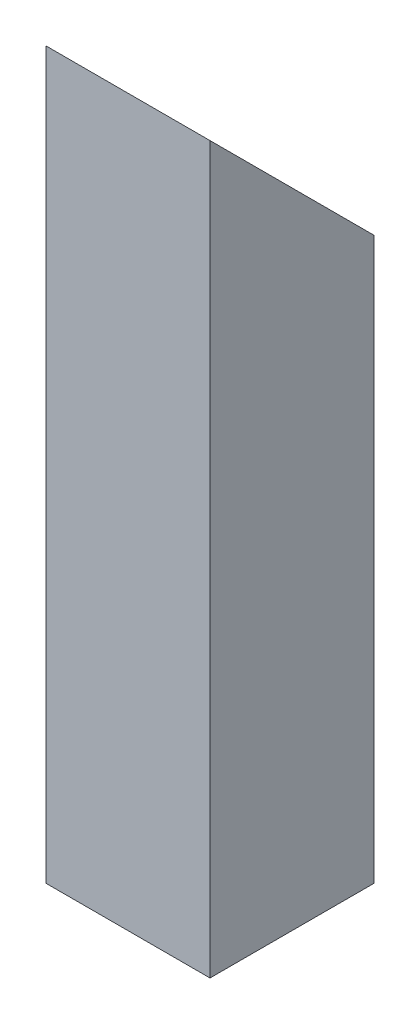
ISO-10303-21;
HEADER;
FILE_DESCRIPTION(('STEP AP214'),'2;1');
FILE_NAME('part.step','',(''),(''),'','','');
FILE_SCHEMA(('AUTOMOTIVE_DESIGN { 1 0 10303 214 1 1 1 1 }'));
ENDSEC;
DATA;
#1=APPLICATION_CONTEXT('core data for automotive mechanical design processes');
#2=APPLICATION_PROTOCOL_DEFINITION('international standard','automotive_design',2000,#1);
#3=PRODUCT_CONTEXT('',#1,'mechanical');
#4=PRODUCT('Part','Part','',(#3));
#5=PRODUCT_RELATED_PRODUCT_CATEGORY('part','',(#4));
#6=PRODUCT_DEFINITION_FORMATION('','',#4);
#7=PRODUCT_DEFINITION_CONTEXT('part definition',#1,'design');
#8=PRODUCT_DEFINITION('design','',#6,#7);
#9=PRODUCT_DEFINITION_SHAPE('','',#8);
#10=(LENGTH_UNIT() NAMED_UNIT(*) SI_UNIT(.MILLI.,.METRE.));
#11=(NAMED_UNIT(*) PLANE_ANGLE_UNIT() SI_UNIT($,.RADIAN.));
#12=(NAMED_UNIT(*) SI_UNIT($,.STERADIAN.) SOLID_ANGLE_UNIT());
#13=UNCERTAINTY_MEASURE_WITH_UNIT(LENGTH_MEASURE(1.E-05),#10,'distance_accuracy_value','');
#14=(GEOMETRIC_REPRESENTATION_CONTEXT(3) GLOBAL_UNCERTAINTY_ASSIGNED_CONTEXT((#13)) GLOBAL_UNIT_ASSIGNED_CONTEXT((#10,
#11,#12)) REPRESENTATION_CONTEXT('',''));
#15=CARTESIAN_POINT('',(0.,0.,0.));
#16=DIRECTION('',(0.,0.,1.));
#17=DIRECTION('',(1.,0.,0.));
#18=AXIS2_PLACEMENT_3D('',#15,#16,#17);
#19=CARTESIAN_POINT('',(44.45,0.,-44.45));
#20=DIRECTION('',(0.,0.,-1.));
#21=DIRECTION('',(-1.,0.,0.));
#22=AXIS2_PLACEMENT_3D('',#19,#20,#21);
#23=PLANE('',#22);
#24=DIRECTION('',(0.,1.,0.));
#25=VECTOR('',#24,1.);
#26=CARTESIAN_POINT('',(0.,0.,-44.45));
#27=LINE('',#26,#25);
#28=CARTESIAN_POINT('',(0.,152.4,-44.45));
#29=VERTEX_POINT('',#28);
#30=CARTESIAN_POINT('',(0.,0.,-44.45));
#31=VERTEX_POINT('',#30);
#32=EDGE_CURVE('E88',#29,#31,#27,.F.);
#33=ORIENTED_EDGE('',*,*,#32,.F.);
#34=DIRECTION('',(1.,0.,0.));
#35=VECTOR('',#34,1.);
#36=CARTESIAN_POINT('',(22.225,152.4,-44.45));
#37=LINE('',#36,#35);
#38=CARTESIAN_POINT('',(44.45,152.4,-44.45));
#39=VERTEX_POINT('',#38);
#40=EDGE_CURVE('E133',#39,#29,#37,.F.);
#41=ORIENTED_EDGE('',*,*,#40,.F.);
#42=DIRECTION('',(0.,1.,0.));
#43=VECTOR('',#42,1.);
#44=CARTESIAN_POINT('',(44.45,0.,-44.45));
#45=LINE('',#44,#43);
#46=CARTESIAN_POINT('',(44.45,0.,-44.45));
#47=VERTEX_POINT('',#46);
#48=EDGE_CURVE('E140',#47,#39,#45,.T.);
#49=ORIENTED_EDGE('',*,*,#48,.F.);
#50=DIRECTION('',(1.,0.,0.));
#51=VECTOR('',#50,1.);
#52=CARTESIAN_POINT('',(0.,0.,-44.45));
#53=LINE('',#52,#51);
#54=EDGE_CURVE('E109',#47,#31,#53,.F.);
#55=ORIENTED_EDGE('',*,*,#54,.T.);
#56=EDGE_LOOP('',(#33,#41,#49,#55));
#57=FACE_BOUND('',#56,.T.);
#58=ADVANCED_FACE('F16',(#57),#23,.T.);
#59=CARTESIAN_POINT('',(41.275,0.,-41.275));
#60=DIRECTION('',(-1.,0.,0.));
#61=DIRECTION('',(0.,0.,1.));
#62=AXIS2_PLACEMENT_3D('',#59,#60,#61);
#63=PLANE('',#62);
#64=DIRECTION('',(0.,1.,0.));
#65=VECTOR('',#64,1.);
#66=CARTESIAN_POINT('',(41.275,0.,-3.175));
#67=LINE('',#66,#65);
#68=CARTESIAN_POINT('',(41.275,193.675,-3.17499999999998));
#69=VERTEX_POINT('',#68);
#70=CARTESIAN_POINT('',(41.275,0.,-3.175));
#71=VERTEX_POINT('',#70);
#72=EDGE_CURVE('E19',#69,#71,#67,.F.);
#73=ORIENTED_EDGE('',*,*,#72,.F.);
#74=DIRECTION('',(0.,0.707106781186548,0.707106781186548));
#75=VECTOR('',#74,1.);
#76=CARTESIAN_POINT('',(41.275,174.625,-22.225));
#77=LINE('',#76,#75);
#78=CARTESIAN_POINT('',(41.275,155.575,-41.275));
#79=VERTEX_POINT('',#78);
#80=EDGE_CURVE('E84',#79,#69,#77,.T.);
#81=ORIENTED_EDGE('',*,*,#80,.F.);
#82=DIRECTION('',(0.,1.,0.));
#83=VECTOR('',#82,1.);
#84=CARTESIAN_POINT('',(41.275,0.,-41.275));
#85=LINE('',#84,#83);
#86=CARTESIAN_POINT('',(41.275,0.,-41.275));
#87=VERTEX_POINT('',#86);
#88=EDGE_CURVE('E77',#87,#79,#85,.T.);
#89=ORIENTED_EDGE('',*,*,#88,.F.);
#90=DIRECTION('',(0.,0.,1.));
#91=VECTOR('',#90,1.);
#92=CARTESIAN_POINT('',(41.275,0.,0.));
#93=LINE('',#92,#91);
#94=EDGE_CURVE('E81',#87,#71,#93,.T.);
#95=ORIENTED_EDGE('',*,*,#94,.T.);
#96=EDGE_LOOP('',(#73,#81,#89,#95));
#97=FACE_BOUND('',#96,.T.);
#98=ADVANCED_FACE('F79',(#97),#63,.T.);
#99=CARTESIAN_POINT('',(41.275,0.,-3.175));
#100=DIRECTION('',(0.,0.,-1.));
#101=DIRECTION('',(-1.,0.,0.));
#102=AXIS2_PLACEMENT_3D('',#99,#100,#101);
#103=PLANE('',#102);
#104=DIRECTION('',(0.,1.,0.));
#105=VECTOR('',#104,1.);
#106=CARTESIAN_POINT('',(3.175,0.,-3.175));
#107=LINE('',#106,#105);
#108=CARTESIAN_POINT('',(3.175,193.675,-3.17499999999999));
#109=VERTEX_POINT('',#108);
#110=CARTESIAN_POINT('',(3.175,0.,-3.175));
#111=VERTEX_POINT('',#110);
#112=EDGE_CURVE('E114',#109,#111,#107,.F.);
#113=ORIENTED_EDGE('',*,*,#112,.F.);
#114=DIRECTION('',(1.,0.,0.));
#115=VECTOR('',#114,1.);
#116=CARTESIAN_POINT('',(22.225,193.675,-3.17500000000001));
#117=LINE('',#116,#115);
#118=EDGE_CURVE('E122',#69,#109,#117,.F.);
#119=ORIENTED_EDGE('',*,*,#118,.F.);
#120=ORIENTED_EDGE('',*,*,#72,.T.);
#121=DIRECTION('',(1.,0.,0.));
#122=VECTOR('',#121,1.);
#123=CARTESIAN_POINT('',(0.,0.,-3.175));
#124=LINE('',#123,#122);
#125=EDGE_CURVE('E102',#71,#111,#124,.F.);
#126=ORIENTED_EDGE('',*,*,#125,.T.);
#127=EDGE_LOOP('',(#113,#119,#120,#126));
#128=FACE_BOUND('',#127,.T.);
#129=ADVANCED_FACE('F120',(#128),#103,.T.);
#130=CARTESIAN_POINT('',(3.175,0.,-3.175));
#131=DIRECTION('',(1.,0.,0.));
#132=DIRECTION('',(0.,0.,-1.));
#133=AXIS2_PLACEMENT_3D('',#130,#131,#132);
#134=PLANE('',#133);
#135=DIRECTION('',(0.,1.,0.));
#136=VECTOR('',#135,1.);
#137=CARTESIAN_POINT('',(3.175,0.,-41.275));
#138=LINE('',#137,#136);
#139=CARTESIAN_POINT('',(3.175,155.575,-41.275));
#140=VERTEX_POINT('',#139);
#141=CARTESIAN_POINT('',(3.175,0.,-41.275));
#142=VERTEX_POINT('',#141);
#143=EDGE_CURVE('E89',#140,#142,#138,.F.);
#144=ORIENTED_EDGE('',*,*,#143,.F.);
#145=DIRECTION('',(0.,0.707106781186548,0.707106781186548));
#146=VECTOR('',#145,1.);
#147=CARTESIAN_POINT('',(3.17499999999999,174.625,-22.225));
#148=LINE('',#147,#146);
#149=EDGE_CURVE('E125',#109,#140,#148,.F.);
#150=ORIENTED_EDGE('',*,*,#149,.F.);
#151=ORIENTED_EDGE('',*,*,#112,.T.);
#152=DIRECTION('',(0.,0.,1.));
#153=VECTOR('',#152,1.);
#154=CARTESIAN_POINT('',(3.175,0.,0.));
#155=LINE('',#154,#153);
#156=EDGE_CURVE('E104',#111,#142,#155,.F.);
#157=ORIENTED_EDGE('',*,*,#156,.T.);
#158=EDGE_LOOP('',(#144,#150,#151,#157));
#159=FACE_BOUND('',#158,.T.);
#160=ADVANCED_FACE('F144',(#159),#134,.T.);
#161=CARTESIAN_POINT('',(3.175,0.,-41.275));
#162=DIRECTION('',(0.,0.,1.));
#163=DIRECTION('',(1.,0.,0.));
#164=AXIS2_PLACEMENT_3D('',#161,#162,#163);
#165=PLANE('',#164);
#166=ORIENTED_EDGE('',*,*,#88,.T.);
#167=DIRECTION('',(1.,0.,0.));
#168=VECTOR('',#167,1.);
#169=CARTESIAN_POINT('',(22.225,155.575,-41.275));
#170=LINE('',#169,#168);
#171=EDGE_CURVE('E129',#140,#79,#170,.T.);
#172=ORIENTED_EDGE('',*,*,#171,.F.);
#173=ORIENTED_EDGE('',*,*,#143,.T.);
#174=DIRECTION('',(1.,0.,0.));
#175=VECTOR('',#174,1.);
#176=CARTESIAN_POINT('',(0.,0.,-41.275));
#177=LINE('',#176,#175);
#178=EDGE_CURVE('E92',#142,#87,#177,.T.);
#179=ORIENTED_EDGE('',*,*,#178,.T.);
#180=EDGE_LOOP('',(#166,#172,#173,#179));
#181=FACE_BOUND('',#180,.T.);
#182=ADVANCED_FACE('F93',(#181),#165,.T.);
#183=CARTESIAN_POINT('',(0.,0.,-44.45));
#184=DIRECTION('',(-1.,0.,0.));
#185=DIRECTION('',(0.,0.,1.));
#186=AXIS2_PLACEMENT_3D('',#183,#184,#185);
#187=PLANE('',#186);
#188=DIRECTION('',(0.,1.,0.));
#189=VECTOR('',#188,1.);
#190=CARTESIAN_POINT('',(0.,0.,0.));
#191=LINE('',#190,#189);
#192=CARTESIAN_POINT('',(0.,196.85,0.));
#193=VERTEX_POINT('',#192);
#194=CARTESIAN_POINT('',(0.,0.,0.));
#195=VERTEX_POINT('',#194);
#196=EDGE_CURVE('E145',#193,#195,#191,.F.);
#197=ORIENTED_EDGE('',*,*,#196,.F.);
#198=DIRECTION('',(0.,0.707106781186548,0.707106781186548));
#199=VECTOR('',#198,1.);
#200=CARTESIAN_POINT('',(0.,174.625,-22.225));
#201=LINE('',#200,#199);
#202=EDGE_CURVE('E130',#29,#193,#201,.T.);
#203=ORIENTED_EDGE('',*,*,#202,.F.);
#204=ORIENTED_EDGE('',*,*,#32,.T.);
#205=DIRECTION('',(0.,0.,1.));
#206=VECTOR('',#205,1.);
#207=CARTESIAN_POINT('',(0.,0.,0.));
#208=LINE('',#207,#206);
#209=EDGE_CURVE('E97',#31,#195,#208,.T.);
#210=ORIENTED_EDGE('',*,*,#209,.T.);
#211=EDGE_LOOP('',(#197,#203,#204,#210));
#212=FACE_BOUND('',#211,.T.);
#213=ADVANCED_FACE('F164',(#212),#187,.T.);
#214=CARTESIAN_POINT('',(0.,0.,0.));
#215=DIRECTION('',(0.,1.,0.));
#216=DIRECTION('',(0.,0.,1.));
#217=AXIS2_PLACEMENT_3D('',#214,#215,#216);
#218=PLANE('',#217);
#219=ORIENTED_EDGE('',*,*,#125,.F.);
#220=ORIENTED_EDGE('',*,*,#94,.F.);
#221=ORIENTED_EDGE('',*,*,#178,.F.);
#222=ORIENTED_EDGE('',*,*,#156,.F.);
#223=EDGE_LOOP('',(#219,#220,#221,#222));
#224=FACE_BOUND('',#223,.T.);
#225=ORIENTED_EDGE('',*,*,#54,.F.);
#226=DIRECTION('',(0.,0.,-1.));
#227=VECTOR('',#226,1.);
#228=CARTESIAN_POINT('',(44.45,0.,0.));
#229=LINE('',#228,#227);
#230=CARTESIAN_POINT('',(44.45,0.,0.));
#231=VERTEX_POINT('',#230);
#232=EDGE_CURVE('E142',#231,#47,#229,.T.);
#233=ORIENTED_EDGE('',*,*,#232,.F.);
#234=DIRECTION('',(1.,0.,0.));
#235=VECTOR('',#234,1.);
#236=CARTESIAN_POINT('',(0.,0.,0.));
#237=LINE('',#236,#235);
#238=EDGE_CURVE('E150',#195,#231,#237,.T.);
#239=ORIENTED_EDGE('',*,*,#238,.F.);
#240=ORIENTED_EDGE('',*,*,#209,.F.);
#241=EDGE_LOOP('',(#225,#233,#239,#240));
#242=FACE_BOUND('',#241,.T.);
#243=ADVANCED_FACE('F100',(#224,#242),#218,.F.);
#244=CARTESIAN_POINT('',(44.45,0.,0.));
#245=DIRECTION('',(1.,0.,0.));
#246=DIRECTION('',(0.,0.,-1.));
#247=AXIS2_PLACEMENT_3D('',#244,#245,#246);
#248=PLANE('',#247);
#249=ORIENTED_EDGE('',*,*,#48,.T.);
#250=DIRECTION('',(0.,0.707106781186548,0.707106781186548));
#251=VECTOR('',#250,1.);
#252=CARTESIAN_POINT('',(44.45,174.625,-22.225));
#253=LINE('',#252,#251);
#254=CARTESIAN_POINT('',(44.45,196.85,0.));
#255=VERTEX_POINT('',#254);
#256=EDGE_CURVE('E34',#255,#39,#253,.F.);
#257=ORIENTED_EDGE('',*,*,#256,.F.);
#258=DIRECTION('',(0.,1.,0.));
#259=VECTOR('',#258,1.);
#260=CARTESIAN_POINT('',(44.45,0.,0.));
#261=LINE('',#260,#259);
#262=EDGE_CURVE('E25',#231,#255,#261,.T.);
#263=ORIENTED_EDGE('',*,*,#262,.F.);
#264=ORIENTED_EDGE('',*,*,#232,.T.);
#265=EDGE_LOOP('',(#249,#257,#263,#264));
#266=FACE_BOUND('',#265,.T.);
#267=ADVANCED_FACE('F157',(#266),#248,.T.);
#268=CARTESIAN_POINT('',(22.225,174.625,-22.225));
#269=DIRECTION('',(0.,0.707106781186548,-0.707106781186548));
#270=DIRECTION('',(0.,0.707106781186548,0.707106781186548));
#271=AXIS2_PLACEMENT_3D('',#268,#269,#270);
#272=PLANE('',#271);
#273=ORIENTED_EDGE('',*,*,#149,.T.);
#274=ORIENTED_EDGE('',*,*,#171,.T.);
#275=ORIENTED_EDGE('',*,*,#80,.T.);
#276=ORIENTED_EDGE('',*,*,#118,.T.);
#277=EDGE_LOOP('',(#273,#274,#275,#276));
#278=FACE_BOUND('',#277,.T.);
#279=ORIENTED_EDGE('',*,*,#40,.T.);
#280=ORIENTED_EDGE('',*,*,#202,.T.);
#281=DIRECTION('',(1.,0.,0.));
#282=VECTOR('',#281,1.);
#283=CARTESIAN_POINT('',(0.,196.85,0.));
#284=LINE('',#283,#282);
#285=EDGE_CURVE('E11',#255,#193,#284,.F.);
#286=ORIENTED_EDGE('',*,*,#285,.F.);
#287=ORIENTED_EDGE('',*,*,#256,.T.);
#288=EDGE_LOOP('',(#279,#280,#286,#287));
#289=FACE_BOUND('',#288,.T.);
#290=ADVANCED_FACE('F127',(#278,#289),#272,.T.);
#291=CARTESIAN_POINT('',(0.,0.,0.));
#292=DIRECTION('',(0.,0.,1.));
#293=DIRECTION('',(1.,0.,0.));
#294=AXIS2_PLACEMENT_3D('',#291,#292,#293);
#295=PLANE('',#294);
#296=ORIENTED_EDGE('',*,*,#262,.T.);
#297=ORIENTED_EDGE('',*,*,#285,.T.);
#298=ORIENTED_EDGE('',*,*,#196,.T.);
#299=ORIENTED_EDGE('',*,*,#238,.T.);
#300=EDGE_LOOP('',(#296,#297,#298,#299));
#301=FACE_BOUND('',#300,.T.);
#302=ADVANCED_FACE('F155',(#301),#295,.T.);
#303=CLOSED_SHELL('',(#58,#98,#129,#160,#182,#213,#243,#267,#290,#302));
#304=MANIFOLD_SOLID_BREP('B1',#303);
#305=ADVANCED_BREP_SHAPE_REPRESENTATION('',(#18,#304),#14);
#306=SHAPE_DEFINITION_REPRESENTATION(#9,#305);
ENDSEC;
END-ISO-10303-21;
